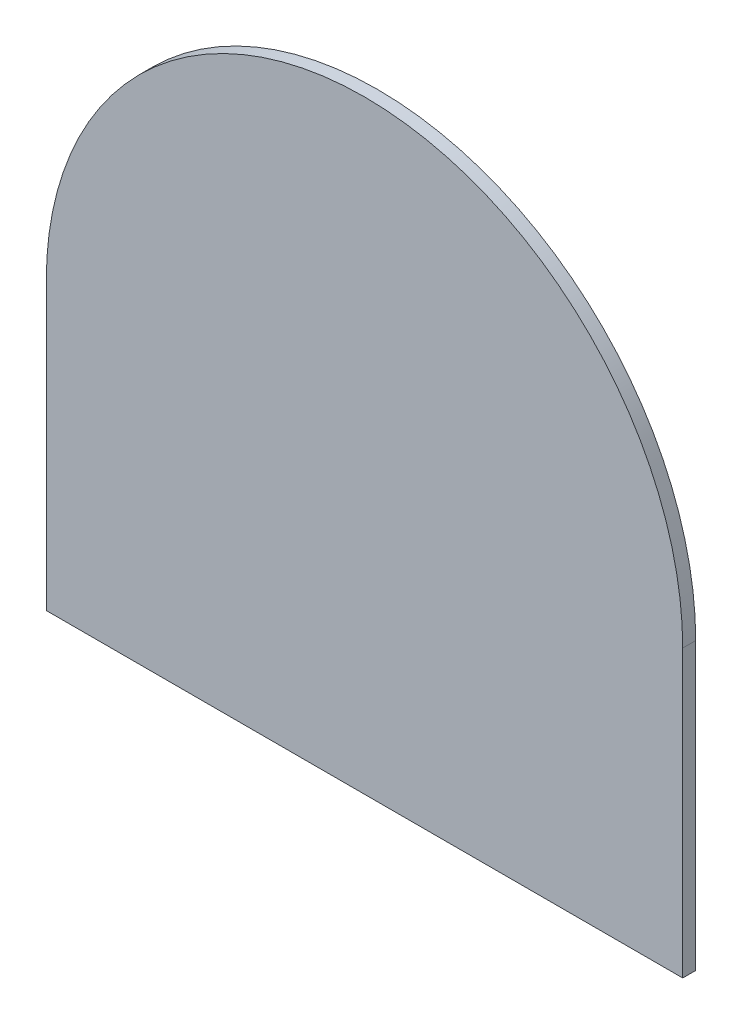
ISO-10303-21;
HEADER;
FILE_DESCRIPTION(('STEP AP214'),'2;1');
FILE_NAME('part.step','',(''),(''),'','','');
FILE_SCHEMA(('AUTOMOTIVE_DESIGN { 1 0 10303 214 1 1 1 1 }'));
ENDSEC;
DATA;
#1=APPLICATION_CONTEXT('core data for automotive mechanical design processes');
#2=APPLICATION_PROTOCOL_DEFINITION('international standard','automotive_design',2000,#1);
#3=PRODUCT_CONTEXT('',#1,'mechanical');
#4=PRODUCT('Part','Part','',(#3));
#5=PRODUCT_RELATED_PRODUCT_CATEGORY('part','',(#4));
#6=PRODUCT_DEFINITION_FORMATION('','',#4);
#7=PRODUCT_DEFINITION_CONTEXT('part definition',#1,'design');
#8=PRODUCT_DEFINITION('design','',#6,#7);
#9=PRODUCT_DEFINITION_SHAPE('','',#8);
#10=(LENGTH_UNIT() NAMED_UNIT(*) SI_UNIT(.MILLI.,.METRE.));
#11=(NAMED_UNIT(*) PLANE_ANGLE_UNIT() SI_UNIT($,.RADIAN.));
#12=(NAMED_UNIT(*) SI_UNIT($,.STERADIAN.) SOLID_ANGLE_UNIT());
#13=UNCERTAINTY_MEASURE_WITH_UNIT(LENGTH_MEASURE(1.E-05),#10,'distance_accuracy_value','');
#14=(GEOMETRIC_REPRESENTATION_CONTEXT(3) GLOBAL_UNCERTAINTY_ASSIGNED_CONTEXT((#13)) GLOBAL_UNIT_ASSIGNED_CONTEXT((#10,
#11,#12)) REPRESENTATION_CONTEXT('',''));
#15=CARTESIAN_POINT('',(0.,0.,0.));
#16=DIRECTION('',(0.,0.,1.));
#17=DIRECTION('',(1.,0.,0.));
#18=AXIS2_PLACEMENT_3D('',#15,#16,#17);
#19=CARTESIAN_POINT('',(0.,0.,1.));
#20=DIRECTION('',(1.,0.,0.));
#21=DIRECTION('',(0.,0.,-1.));
#22=AXIS2_PLACEMENT_3D('',#19,#20,#21);
#23=PLANE('',#22);
#24=DIRECTION('',(0.,-1.,0.));
#25=VECTOR('',#24,1.);
#26=CARTESIAN_POINT('',(0.,0.,0.));
#27=LINE('',#26,#25);
#28=CARTESIAN_POINT('',(0.,22.,0.));
#29=VERTEX_POINT('',#28);
#30=CARTESIAN_POINT('',(0.,0.,0.));
#31=VERTEX_POINT('',#30);
#32=EDGE_CURVE('E101',#29,#31,#27,.T.);
#33=ORIENTED_EDGE('',*,*,#32,.T.);
#34=DIRECTION('',(0.,0.,-1.));
#35=VECTOR('',#34,1.);
#36=CARTESIAN_POINT('',(0.,0.,1.));
#37=LINE('',#36,#35);
#38=CARTESIAN_POINT('',(0.,0.,1.));
#39=VERTEX_POINT('',#38);
#40=EDGE_CURVE('E11',#39,#31,#37,.T.);
#41=ORIENTED_EDGE('',*,*,#40,.F.);
#42=DIRECTION('',(0.,-1.,0.));
#43=VECTOR('',#42,1.);
#44=CARTESIAN_POINT('',(0.,0.,1.));
#45=LINE('',#44,#43);
#46=CARTESIAN_POINT('',(0.,22.,1.));
#47=VERTEX_POINT('',#46);
#48=EDGE_CURVE('E87',#47,#39,#45,.T.);
#49=ORIENTED_EDGE('',*,*,#48,.F.);
#50=DIRECTION('',(0.,0.,-1.));
#51=VECTOR('',#50,1.);
#52=CARTESIAN_POINT('',(0.,22.,1.));
#53=LINE('',#52,#51);
#54=EDGE_CURVE('E97',#47,#29,#53,.T.);
#55=ORIENTED_EDGE('',*,*,#54,.T.);
#56=EDGE_LOOP('',(#33,#41,#49,#55));
#57=FACE_BOUND('',#56,.T.);
#58=ADVANCED_FACE('F37',(#57),#23,.F.);
#59=CARTESIAN_POINT('',(0.,0.,1.));
#60=DIRECTION('',(0.,1.,0.));
#61=DIRECTION('',(0.,0.,1.));
#62=AXIS2_PLACEMENT_3D('',#59,#60,#61);
#63=PLANE('',#62);
#64=DIRECTION('',(1.,0.,0.));
#65=VECTOR('',#64,1.);
#66=CARTESIAN_POINT('',(0.,0.,0.));
#67=LINE('',#66,#65);
#68=CARTESIAN_POINT('',(49.,0.,0.));
#69=VERTEX_POINT('',#68);
#70=EDGE_CURVE('E92',#31,#69,#67,.T.);
#71=ORIENTED_EDGE('',*,*,#70,.T.);
#72=DIRECTION('',(0.,0.,-1.));
#73=VECTOR('',#72,1.);
#74=CARTESIAN_POINT('',(49.,0.,1.));
#75=LINE('',#74,#73);
#76=CARTESIAN_POINT('',(49.,0.,1.));
#77=VERTEX_POINT('',#76);
#78=EDGE_CURVE('E45',#77,#69,#75,.T.);
#79=ORIENTED_EDGE('',*,*,#78,.F.);
#80=DIRECTION('',(1.,0.,0.));
#81=VECTOR('',#80,1.);
#82=CARTESIAN_POINT('',(0.,0.,1.));
#83=LINE('',#82,#81);
#84=EDGE_CURVE('E81',#39,#77,#83,.T.);
#85=ORIENTED_EDGE('',*,*,#84,.F.);
#86=ORIENTED_EDGE('',*,*,#40,.T.);
#87=EDGE_LOOP('',(#71,#79,#85,#86));
#88=FACE_BOUND('',#87,.T.);
#89=ADVANCED_FACE('F91',(#88),#63,.F.);
#90=CARTESIAN_POINT('',(49.,0.,1.));
#91=DIRECTION('',(-1.,0.,0.));
#92=DIRECTION('',(0.,-1.,0.));
#93=AXIS2_PLACEMENT_3D('',#90,#91,#92);
#94=PLANE('',#93);
#95=DIRECTION('',(0.,1.,0.));
#96=VECTOR('',#95,1.);
#97=CARTESIAN_POINT('',(49.,0.,0.));
#98=LINE('',#97,#96);
#99=CARTESIAN_POINT('',(49.,22.,0.));
#100=VERTEX_POINT('',#99);
#101=EDGE_CURVE('E105',#69,#100,#98,.T.);
#102=ORIENTED_EDGE('',*,*,#101,.T.);
#103=DIRECTION('',(0.,0.,-1.));
#104=VECTOR('',#103,1.);
#105=CARTESIAN_POINT('',(49.,22.,1.));
#106=LINE('',#105,#104);
#107=CARTESIAN_POINT('',(49.,22.,1.));
#108=VERTEX_POINT('',#107);
#109=EDGE_CURVE('E94',#108,#100,#106,.T.);
#110=ORIENTED_EDGE('',*,*,#109,.F.);
#111=DIRECTION('',(0.,1.,0.));
#112=VECTOR('',#111,1.);
#113=CARTESIAN_POINT('',(49.,0.,1.));
#114=LINE('',#113,#112);
#115=EDGE_CURVE('E84',#77,#108,#114,.T.);
#116=ORIENTED_EDGE('',*,*,#115,.F.);
#117=ORIENTED_EDGE('',*,*,#78,.T.);
#118=EDGE_LOOP('',(#102,#110,#116,#117));
#119=FACE_BOUND('',#118,.T.);
#120=ADVANCED_FACE('F95',(#119),#94,.F.);
#121=CARTESIAN_POINT('',(24.5,22.,1.));
#122=DIRECTION('',(0.,0.,-1.));
#123=DIRECTION('',(-1.,0.,0.));
#124=AXIS2_PLACEMENT_3D('',#121,#122,#123);
#125=CYLINDRICAL_SURFACE('',#124,24.5);
#126=CARTESIAN_POINT('',(24.5,22.,0.));
#127=DIRECTION('',(0.,0.,1.));
#128=DIRECTION('',(-1.,0.,0.));
#129=AXIS2_PLACEMENT_3D('',#126,#127,#128);
#130=CIRCLE('',#129,24.5);
#131=EDGE_CURVE('E70',#100,#29,#130,.T.);
#132=ORIENTED_EDGE('',*,*,#131,.T.);
#133=ORIENTED_EDGE('',*,*,#54,.F.);
#134=CARTESIAN_POINT('',(24.5,22.,1.));
#135=DIRECTION('',(0.,0.,1.));
#136=DIRECTION('',(-1.,0.,0.));
#137=AXIS2_PLACEMENT_3D('',#134,#135,#136);
#138=CIRCLE('',#137,24.5);
#139=EDGE_CURVE('E53',#108,#47,#138,.T.);
#140=ORIENTED_EDGE('',*,*,#139,.F.);
#141=ORIENTED_EDGE('',*,*,#109,.T.);
#142=EDGE_LOOP('',(#132,#133,#140,#141));
#143=FACE_BOUND('',#142,.T.);
#144=ADVANCED_FACE('F109',(#143),#125,.T.);
#145=CARTESIAN_POINT('',(24.5,22.,1.));
#146=DIRECTION('',(0.,0.,-1.));
#147=DIRECTION('',(-1.,0.,0.));
#148=AXIS2_PLACEMENT_3D('',#145,#146,#147);
#149=PLANE('',#148);
#150=ORIENTED_EDGE('',*,*,#48,.T.);
#151=ORIENTED_EDGE('',*,*,#84,.T.);
#152=ORIENTED_EDGE('',*,*,#115,.T.);
#153=ORIENTED_EDGE('',*,*,#139,.T.);
#154=EDGE_LOOP('',(#150,#151,#152,#153));
#155=FACE_BOUND('',#154,.T.);
#156=ADVANCED_FACE('F82',(#155),#149,.F.);
#157=CARTESIAN_POINT('',(24.5,22.,0.));
#158=DIRECTION('',(0.,0.,-1.));
#159=DIRECTION('',(-1.,0.,0.));
#160=AXIS2_PLACEMENT_3D('',#157,#158,#159);
#161=PLANE('',#160);
#162=ORIENTED_EDGE('',*,*,#32,.F.);
#163=ORIENTED_EDGE('',*,*,#131,.F.);
#164=ORIENTED_EDGE('',*,*,#101,.F.);
#165=ORIENTED_EDGE('',*,*,#70,.F.);
#166=EDGE_LOOP('',(#162,#163,#164,#165));
#167=FACE_BOUND('',#166,.T.);
#168=ADVANCED_FACE('F111',(#167),#161,.T.);
#169=CLOSED_SHELL('',(#58,#89,#120,#144,#156,#168));
#170=MANIFOLD_SOLID_BREP('B2',#169);
#171=ADVANCED_BREP_SHAPE_REPRESENTATION('',(#18,#170),#14);
#172=SHAPE_DEFINITION_REPRESENTATION(#9,#171);
ENDSEC;
END-ISO-10303-21;
